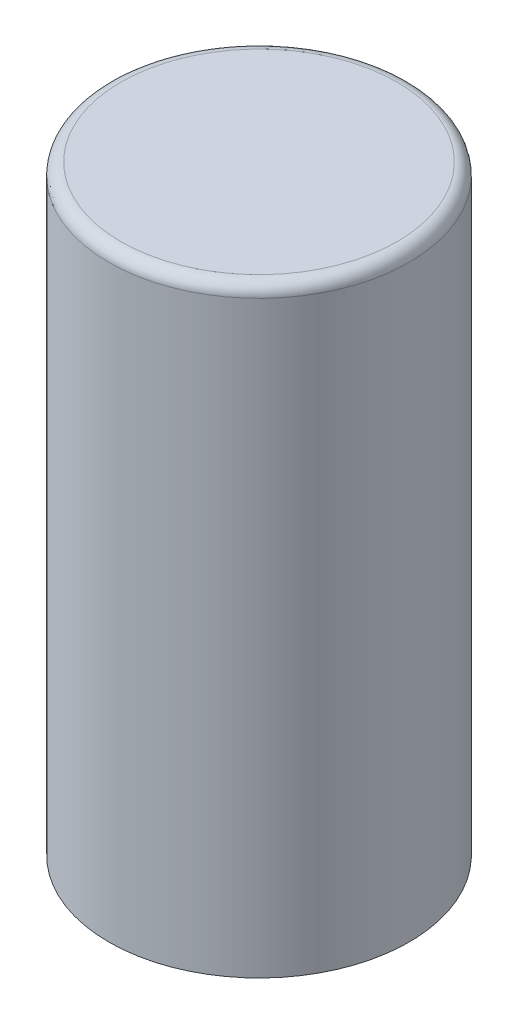
ISO-10303-21;
HEADER;
FILE_DESCRIPTION(('STEP AP214'),'2;1');
FILE_NAME('part.step','',(''),(''),'','','');
FILE_SCHEMA(('AUTOMOTIVE_DESIGN { 1 0 10303 214 1 1 1 1 }'));
ENDSEC;
DATA;
#1=APPLICATION_CONTEXT('core data for automotive mechanical design processes');
#2=APPLICATION_PROTOCOL_DEFINITION('international standard','automotive_design',2000,#1);
#3=PRODUCT_CONTEXT('',#1,'mechanical');
#4=PRODUCT('Part','Part','',(#3));
#5=PRODUCT_RELATED_PRODUCT_CATEGORY('part','',(#4));
#6=PRODUCT_DEFINITION_FORMATION('','',#4);
#7=PRODUCT_DEFINITION_CONTEXT('part definition',#1,'design');
#8=PRODUCT_DEFINITION('design','',#6,#7);
#9=PRODUCT_DEFINITION_SHAPE('','',#8);
#10=(LENGTH_UNIT() NAMED_UNIT(*) SI_UNIT(.MILLI.,.METRE.));
#11=(NAMED_UNIT(*) PLANE_ANGLE_UNIT() SI_UNIT($,.RADIAN.));
#12=(NAMED_UNIT(*) SI_UNIT($,.STERADIAN.) SOLID_ANGLE_UNIT());
#13=UNCERTAINTY_MEASURE_WITH_UNIT(LENGTH_MEASURE(1.E-05),#10,'distance_accuracy_value','');
#14=(GEOMETRIC_REPRESENTATION_CONTEXT(3) GLOBAL_UNCERTAINTY_ASSIGNED_CONTEXT((#13)) GLOBAL_UNIT_ASSIGNED_CONTEXT((#10,
#11,#12)) REPRESENTATION_CONTEXT('',''));
#15=CARTESIAN_POINT('',(0.,0.,0.));
#16=DIRECTION('',(0.,0.,1.));
#17=DIRECTION('',(1.,0.,0.));
#18=AXIS2_PLACEMENT_3D('',#15,#16,#17);
#19=CARTESIAN_POINT('',(0.,25.,0.));
#20=DIRECTION('',(0.,-1.,0.));
#21=DIRECTION('',(0.,0.,-1.));
#22=AXIS2_PLACEMENT_3D('',#19,#20,#21);
#23=CYLINDRICAL_SURFACE('',#22,6.25);
#24=CARTESIAN_POINT('',(0.,24.5,0.));
#25=DIRECTION('',(0.,1.,0.));
#26=DIRECTION('',(0.,0.,1.));
#27=AXIS2_PLACEMENT_3D('',#24,#25,#26);
#28=CIRCLE('',#27,6.25);
#29=CARTESIAN_POINT('',(0.,24.5,6.25));
#30=VERTEX_POINT('',#29);
#31=EDGE_CURVE('E10',#30,#30,#28,.F.);
#32=ORIENTED_EDGE('',*,*,#31,.T.);
#33=EDGE_LOOP('',(#32));
#34=FACE_BOUND('',#33,.T.);
#35=CARTESIAN_POINT('',(0.,0.,0.));
#36=DIRECTION('',(0.,1.,0.));
#37=DIRECTION('',(0.,0.,1.));
#38=AXIS2_PLACEMENT_3D('',#35,#36,#37);
#39=CIRCLE('',#38,6.25);
#40=CARTESIAN_POINT('',(0.,0.,6.25));
#41=VERTEX_POINT('',#40);
#42=EDGE_CURVE('E41',#41,#41,#39,.T.);
#43=ORIENTED_EDGE('',*,*,#42,.T.);
#44=EDGE_LOOP('',(#43));
#45=FACE_BOUND('',#44,.T.);
#46=ADVANCED_FACE('F30',(#34,#45),#23,.T.);
#47=CARTESIAN_POINT('',(0.,25.,0.));
#48=DIRECTION('',(0.,1.,0.));
#49=DIRECTION('',(0.,0.,1.));
#50=AXIS2_PLACEMENT_3D('',#47,#48,#49);
#51=PLANE('',#50);
#52=CARTESIAN_POINT('',(0.,25.,0.));
#53=DIRECTION('',(0.,1.,0.));
#54=DIRECTION('',(0.,0.,1.));
#55=AXIS2_PLACEMENT_3D('',#52,#53,#54);
#56=CIRCLE('',#55,5.75);
#57=CARTESIAN_POINT('',(0.,25.,5.75));
#58=VERTEX_POINT('',#57);
#59=EDGE_CURVE('E37',#58,#58,#56,.T.);
#60=ORIENTED_EDGE('',*,*,#59,.T.);
#61=EDGE_LOOP('',(#60));
#62=FACE_BOUND('',#61,.T.);
#63=ADVANCED_FACE('F51',(#62),#51,.T.);
#64=CARTESIAN_POINT('',(0.,0.,0.));
#65=DIRECTION('',(0.,1.,0.));
#66=DIRECTION('',(0.,0.,1.));
#67=AXIS2_PLACEMENT_3D('',#64,#65,#66);
#68=PLANE('',#67);
#69=ORIENTED_EDGE('',*,*,#42,.F.);
#70=EDGE_LOOP('',(#69));
#71=FACE_BOUND('',#70,.T.);
#72=ADVANCED_FACE('F49',(#71),#68,.F.);
#73=CARTESIAN_POINT('',(0.,24.5,0.));
#74=DIRECTION('',(0.,1.,0.));
#75=DIRECTION('',(0.,0.,1.));
#76=AXIS2_PLACEMENT_3D('',#73,#74,#75);
#77=TOROIDAL_SURFACE('',#76,5.75,0.5);
#78=ORIENTED_EDGE('',*,*,#31,.F.);
#79=EDGE_LOOP('',(#78));
#80=FACE_BOUND('',#79,.T.);
#81=ORIENTED_EDGE('',*,*,#59,.F.);
#82=EDGE_LOOP('',(#81));
#83=FACE_BOUND('',#82,.T.);
#84=ADVANCED_FACE('F32',(#80,#83),#77,.T.);
#85=CLOSED_SHELL('',(#46,#63,#72,#84));
#86=MANIFOLD_SOLID_BREP('B2',#85);
#87=ADVANCED_BREP_SHAPE_REPRESENTATION('',(#18,#86),#14);
#88=SHAPE_DEFINITION_REPRESENTATION(#9,#87);
ENDSEC;
END-ISO-10303-21;
